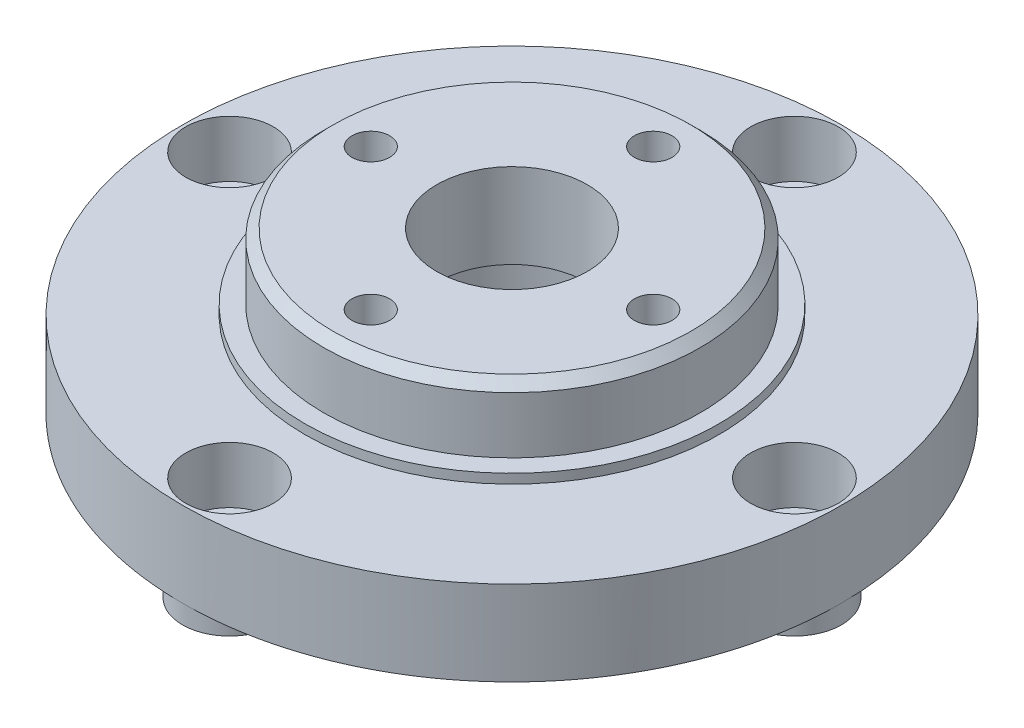
ISO-10303-21;
HEADER;
FILE_DESCRIPTION(('STEP AP214'),'2;1');
FILE_NAME('part.step','',(''),(''),'','','');
FILE_SCHEMA(('AUTOMOTIVE_DESIGN { 1 0 10303 214 1 1 1 1 }'));
ENDSEC;
DATA;
#1=APPLICATION_CONTEXT('core data for automotive mechanical design processes');
#2=APPLICATION_PROTOCOL_DEFINITION('international standard','automotive_design',2000,#1);
#3=PRODUCT_CONTEXT('',#1,'mechanical');
#4=PRODUCT('Part','Part','',(#3));
#5=PRODUCT_RELATED_PRODUCT_CATEGORY('part','',(#4));
#6=PRODUCT_DEFINITION_FORMATION('','',#4);
#7=PRODUCT_DEFINITION_CONTEXT('part definition',#1,'design');
#8=PRODUCT_DEFINITION('design','',#6,#7);
#9=PRODUCT_DEFINITION_SHAPE('','',#8);
#10=(LENGTH_UNIT() NAMED_UNIT(*) SI_UNIT(.MILLI.,.METRE.));
#11=(NAMED_UNIT(*) PLANE_ANGLE_UNIT() SI_UNIT($,.RADIAN.));
#12=(NAMED_UNIT(*) SI_UNIT($,.STERADIAN.) SOLID_ANGLE_UNIT());
#13=UNCERTAINTY_MEASURE_WITH_UNIT(LENGTH_MEASURE(1.E-05),#10,'distance_accuracy_value','');
#14=(GEOMETRIC_REPRESENTATION_CONTEXT(3) GLOBAL_UNCERTAINTY_ASSIGNED_CONTEXT((#13)) GLOBAL_UNIT_ASSIGNED_CONTEXT((#10,
#11,#12)) REPRESENTATION_CONTEXT('',''));
#15=CARTESIAN_POINT('',(0.,0.,0.));
#16=DIRECTION('',(0.,0.,1.));
#17=DIRECTION('',(1.,0.,0.));
#18=AXIS2_PLACEMENT_3D('',#15,#16,#17);
#19=CARTESIAN_POINT('',(0.,0.,0.));
#20=DIRECTION('',(0.,1.,0.));
#21=DIRECTION('',(0.,0.,1.));
#22=AXIS2_PLACEMENT_3D('',#19,#20,#21);
#23=PLANE('',#22);
#24=CARTESIAN_POINT('',(0.,0.,0.));
#25=DIRECTION('',(0.,1.,0.));
#26=DIRECTION('',(0.,0.,1.));
#27=AXIS2_PLACEMENT_3D('',#24,#25,#26);
#28=CIRCLE('',#27,12.1);
#29=CARTESIAN_POINT('',(0.,0.,12.1));
#30=VERTEX_POINT('',#29);
#31=EDGE_CURVE('E89',#30,#30,#28,.T.);
#32=ORIENTED_EDGE('',*,*,#31,.T.);
#33=EDGE_LOOP('',(#32));
#34=FACE_BOUND('',#33,.T.);
#35=CARTESIAN_POINT('',(0.,0.,-15.));
#36=DIRECTION('',(0.,1.,0.));
#37=DIRECTION('',(0.,0.,1.));
#38=AXIS2_PLACEMENT_3D('',#35,#36,#37);
#39=CIRCLE('',#38,2.);
#40=CARTESIAN_POINT('',(0.,0.,-13.));
#41=VERTEX_POINT('',#40);
#42=EDGE_CURVE('E580',#41,#41,#39,.T.);
#43=ORIENTED_EDGE('',*,*,#42,.T.);
#44=EDGE_LOOP('',(#43));
#45=FACE_BOUND('',#44,.T.);
#46=CARTESIAN_POINT('',(15.0000000000004,0.,-4.23570186157979E-13));
#47=DIRECTION('',(0.,1.,0.));
#48=DIRECTION('',(0.,0.,1.));
#49=AXIS2_PLACEMENT_3D('',#46,#47,#48);
#50=CIRCLE('',#49,2.00000000000033);
#51=CARTESIAN_POINT('',(15.0000000000004,0.,1.99999999999991));
#52=VERTEX_POINT('',#51);
#53=EDGE_CURVE('E584',#52,#52,#50,.T.);
#54=ORIENTED_EDGE('',*,*,#53,.T.);
#55=EDGE_LOOP('',(#54));
#56=FACE_BOUND('',#55,.T.);
#57=CARTESIAN_POINT('',(8.47140372315957E-13,0.,15.));
#58=DIRECTION('',(0.,1.,0.));
#59=DIRECTION('',(0.,0.,1.));
#60=AXIS2_PLACEMENT_3D('',#57,#58,#59);
#61=CIRCLE('',#60,2.00000000000091);
#62=CARTESIAN_POINT('',(8.47140372315957E-13,0.,17.0000000000009));
#63=VERTEX_POINT('',#62);
#64=EDGE_CURVE('E587',#63,#63,#61,.T.);
#65=ORIENTED_EDGE('',*,*,#64,.T.);
#66=EDGE_LOOP('',(#65));
#67=FACE_BOUND('',#66,.T.);
#68=CARTESIAN_POINT('',(-14.9999999999996,0.,4.254071563567E-13));
#69=DIRECTION('',(0.,1.,0.));
#70=DIRECTION('',(0.,0.,1.));
#71=AXIS2_PLACEMENT_3D('',#68,#69,#70);
#72=CIRCLE('',#71,2.00000000000068);
#73=CARTESIAN_POINT('',(-14.9999999999996,0.,2.00000000000111));
#74=VERTEX_POINT('',#73);
#75=EDGE_CURVE('E590',#74,#74,#72,.T.);
#76=ORIENTED_EDGE('',*,*,#75,.T.);
#77=EDGE_LOOP('',(#76));
#78=FACE_BOUND('',#77,.T.);
#79=CARTESIAN_POINT('',(0.,0.,0.));
#80=DIRECTION('',(0.,1.,0.));
#81=DIRECTION('',(0.,0.,1.));
#82=AXIS2_PLACEMENT_3D('',#79,#80,#81);
#83=CIRCLE('',#82,35.);
#84=CARTESIAN_POINT('',(0.,0.,-35.));
#85=VERTEX_POINT('',#84);
#86=CARTESIAN_POINT('',(-35.,0.,0.));
#87=VERTEX_POINT('',#86);
#88=EDGE_CURVE('E61',#85,#87,#83,.T.);
#89=ORIENTED_EDGE('',*,*,#88,.F.);
#90=CARTESIAN_POINT('',(0.,0.,-30.));
#91=DIRECTION('',(0.,-1.,0.));
#92=DIRECTION('',(0.,0.,-1.));
#93=AXIS2_PLACEMENT_3D('',#90,#91,#92);
#94=CIRCLE('',#93,5.00000000000001);
#95=EDGE_CURVE('E81',#85,#85,#94,.T.);
#96=ORIENTED_EDGE('',*,*,#95,.F.);
#97=CARTESIAN_POINT('',(35.,0.,0.));
#98=VERTEX_POINT('',#97);
#99=EDGE_CURVE('E71',#98,#85,#83,.T.);
#100=ORIENTED_EDGE('',*,*,#99,.F.);
#101=CARTESIAN_POINT('',(30.,0.,0.));
#102=DIRECTION('',(0.,-1.,0.));
#103=DIRECTION('',(0.,0.,-1.));
#104=AXIS2_PLACEMENT_3D('',#101,#102,#103);
#105=CIRCLE('',#104,5.);
#106=EDGE_CURVE('E568',#98,#98,#105,.T.);
#107=ORIENTED_EDGE('',*,*,#106,.F.);
#108=CARTESIAN_POINT('',(0.,0.,35.));
#109=VERTEX_POINT('',#108);
#110=EDGE_CURVE('E74',#109,#98,#83,.T.);
#111=ORIENTED_EDGE('',*,*,#110,.F.);
#112=CARTESIAN_POINT('',(0.,0.,30.));
#113=DIRECTION('',(0.,-1.,0.));
#114=DIRECTION('',(0.,0.,-1.));
#115=AXIS2_PLACEMENT_3D('',#112,#113,#114);
#116=CIRCLE('',#115,5.00000000000001);
#117=EDGE_CURVE('E559',#109,#109,#116,.T.);
#118=ORIENTED_EDGE('',*,*,#117,.F.);
#119=EDGE_CURVE('E65',#87,#109,#83,.T.);
#120=ORIENTED_EDGE('',*,*,#119,.F.);
#121=CARTESIAN_POINT('',(-30.,0.,0.));
#122=DIRECTION('',(0.,-1.,0.));
#123=DIRECTION('',(0.,0.,-1.));
#124=AXIS2_PLACEMENT_3D('',#121,#122,#123);
#125=CIRCLE('',#124,5.00000000000001);
#126=EDGE_CURVE('E83',#87,#87,#125,.T.);
#127=ORIENTED_EDGE('',*,*,#126,.F.);
#128=EDGE_LOOP('',(#89,#96,#100,#107,#111,#118,#120,#127));
#129=FACE_BOUND('',#128,.T.);
#130=ADVANCED_FACE('F45',(#34,#45,#56,#67,#78,#129),#23,.F.);
#131=CARTESIAN_POINT('',(0.,9.,0.));
#132=DIRECTION('',(0.,1.,0.));
#133=DIRECTION('',(0.,0.,1.));
#134=AXIS2_PLACEMENT_3D('',#131,#132,#133);
#135=PLANE('',#134);
#136=CARTESIAN_POINT('',(0.,9.,0.));
#137=DIRECTION('',(0.,1.,0.));
#138=DIRECTION('',(0.,0.,1.));
#139=AXIS2_PLACEMENT_3D('',#136,#137,#138);
#140=CIRCLE('',#139,35.);
#141=CARTESIAN_POINT('',(0.,9.,35.));
#142=VERTEX_POINT('',#141);
#143=EDGE_CURVE('E178',#142,#142,#140,.T.);
#144=ORIENTED_EDGE('',*,*,#143,.T.);
#145=EDGE_LOOP('',(#144));
#146=FACE_BOUND('',#145,.T.);
#147=CARTESIAN_POINT('',(-30.,9.,0.));
#148=DIRECTION('',(0.,1.,0.));
#149=DIRECTION('',(0.,0.,1.));
#150=AXIS2_PLACEMENT_3D('',#147,#148,#149);
#151=CIRCLE('',#150,4.65);
#152=CARTESIAN_POINT('',(-30.,9.,4.65000000000001));
#153=VERTEX_POINT('',#152);
#154=EDGE_CURVE('E523',#153,#153,#151,.T.);
#155=ORIENTED_EDGE('',*,*,#154,.F.);
#156=EDGE_LOOP('',(#155));
#157=FACE_BOUND('',#156,.T.);
#158=CARTESIAN_POINT('',(0.,9.,-30.));
#159=DIRECTION('',(0.,1.,0.));
#160=DIRECTION('',(0.,0.,1.));
#161=AXIS2_PLACEMENT_3D('',#158,#159,#160);
#162=CIRCLE('',#161,4.65);
#163=CARTESIAN_POINT('',(0.,9.,-25.35));
#164=VERTEX_POINT('',#163);
#165=EDGE_CURVE('E526',#164,#164,#162,.T.);
#166=ORIENTED_EDGE('',*,*,#165,.F.);
#167=EDGE_LOOP('',(#166));
#168=FACE_BOUND('',#167,.T.);
#169=CARTESIAN_POINT('',(30.,9.,0.));
#170=DIRECTION('',(0.,1.,0.));
#171=DIRECTION('',(0.,0.,1.));
#172=AXIS2_PLACEMENT_3D('',#169,#170,#171);
#173=CIRCLE('',#172,4.65);
#174=CARTESIAN_POINT('',(30.,9.,4.65));
#175=VERTEX_POINT('',#174);
#176=EDGE_CURVE('E529',#175,#175,#173,.T.);
#177=ORIENTED_EDGE('',*,*,#176,.F.);
#178=EDGE_LOOP('',(#177));
#179=FACE_BOUND('',#178,.T.);
#180=CARTESIAN_POINT('',(0.,9.,30.));
#181=DIRECTION('',(0.,1.,0.));
#182=DIRECTION('',(0.,0.,1.));
#183=AXIS2_PLACEMENT_3D('',#180,#181,#182);
#184=CIRCLE('',#183,4.65);
#185=CARTESIAN_POINT('',(0.,9.,34.65));
#186=VERTEX_POINT('',#185);
#187=EDGE_CURVE('E186',#186,#186,#184,.T.);
#188=ORIENTED_EDGE('',*,*,#187,.F.);
#189=EDGE_LOOP('',(#188));
#190=FACE_BOUND('',#189,.T.);
#191=CARTESIAN_POINT('',(0.,9.,0.));
#192=DIRECTION('',(0.,1.,0.));
#193=DIRECTION('',(0.,0.,1.));
#194=AXIS2_PLACEMENT_3D('',#191,#192,#193);
#195=CIRCLE('',#194,22.);
#196=CARTESIAN_POINT('',(0.,9.,22.));
#197=VERTEX_POINT('',#196);
#198=EDGE_CURVE('E541',#197,#197,#195,.T.);
#199=ORIENTED_EDGE('',*,*,#198,.F.);
#200=EDGE_LOOP('',(#199));
#201=FACE_BOUND('',#200,.T.);
#202=ADVANCED_FACE('F112',(#146,#157,#168,#179,#190,#201),#135,.T.);
#203=CARTESIAN_POINT('',(0.,3.,0.));
#204=DIRECTION('',(0.,-1.,0.));
#205=DIRECTION('',(0.,0.,-1.));
#206=AXIS2_PLACEMENT_3D('',#203,#204,#205);
#207=CYLINDRICAL_SURFACE('',#206,11.1);
#208=CARTESIAN_POINT('',(0.,1.00000000000002,0.));
#209=DIRECTION('',(0.,1.,0.));
#210=DIRECTION('',(0.,0.,1.));
#211=AXIS2_PLACEMENT_3D('',#208,#209,#210);
#212=CIRCLE('',#211,11.1);
#213=CARTESIAN_POINT('',(0.,1.00000000000002,11.1));
#214=VERTEX_POINT('',#213);
#215=EDGE_CURVE('E91',#214,#214,#212,.F.);
#216=ORIENTED_EDGE('',*,*,#215,.T.);
#217=EDGE_LOOP('',(#216));
#218=FACE_BOUND('',#217,.T.);
#219=CARTESIAN_POINT('',(0.,8.,0.));
#220=DIRECTION('',(0.,1.,0.));
#221=DIRECTION('',(0.,0.,1.));
#222=AXIS2_PLACEMENT_3D('',#219,#220,#221);
#223=CIRCLE('',#222,11.1);
#224=CARTESIAN_POINT('',(0.,8.,11.1));
#225=VERTEX_POINT('',#224);
#226=EDGE_CURVE('E169',#225,#225,#223,.T.);
#227=ORIENTED_EDGE('',*,*,#226,.T.);
#228=EDGE_LOOP('',(#227));
#229=FACE_BOUND('',#228,.T.);
#230=ADVANCED_FACE('F119',(#218,#229),#207,.F.);
#231=CARTESIAN_POINT('',(0.,3.,0.));
#232=DIRECTION('',(0.,1.,0.));
#233=DIRECTION('',(0.,0.,1.));
#234=AXIS2_PLACEMENT_3D('',#231,#232,#233);
#235=PLANE('',#234);
#236=CARTESIAN_POINT('',(0.,3.,30.));
#237=DIRECTION('',(0.,1.,0.));
#238=DIRECTION('',(0.,0.,1.));
#239=AXIS2_PLACEMENT_3D('',#236,#237,#238);
#240=CIRCLE('',#239,2.65);
#241=CARTESIAN_POINT('',(0.,3.,32.65));
#242=VERTEX_POINT('',#241);
#243=EDGE_CURVE('E163',#242,#242,#240,.T.);
#244=ORIENTED_EDGE('',*,*,#243,.F.);
#245=EDGE_LOOP('',(#244));
#246=FACE_BOUND('',#245,.T.);
#247=CARTESIAN_POINT('',(0.,3.,30.));
#248=DIRECTION('',(0.,1.,0.));
#249=DIRECTION('',(0.,0.,1.));
#250=AXIS2_PLACEMENT_3D('',#247,#248,#249);
#251=CIRCLE('',#250,4.65);
#252=CARTESIAN_POINT('',(0.,3.,34.65));
#253=VERTEX_POINT('',#252);
#254=EDGE_CURVE('E166',#253,#253,#251,.T.);
#255=ORIENTED_EDGE('',*,*,#254,.T.);
#256=EDGE_LOOP('',(#255));
#257=FACE_BOUND('',#256,.T.);
#258=ADVANCED_FACE('F125',(#246,#257),#235,.T.);
#259=CARTESIAN_POINT('',(30.,3.,0.));
#260=DIRECTION('',(0.,1.,0.));
#261=DIRECTION('',(0.,0.,1.));
#262=AXIS2_PLACEMENT_3D('',#259,#260,#261);
#263=CIRCLE('',#262,2.65);
#264=CARTESIAN_POINT('',(30.,3.,2.65));
#265=VERTEX_POINT('',#264);
#266=EDGE_CURVE('E86',#265,#265,#263,.T.);
#267=ORIENTED_EDGE('',*,*,#266,.F.);
#268=EDGE_LOOP('',(#267));
#269=FACE_BOUND('',#268,.T.);
#270=CARTESIAN_POINT('',(30.,3.,0.));
#271=DIRECTION('',(0.,1.,0.));
#272=DIRECTION('',(0.,0.,1.));
#273=AXIS2_PLACEMENT_3D('',#270,#271,#272);
#274=CIRCLE('',#273,4.65);
#275=CARTESIAN_POINT('',(30.,3.,4.65));
#276=VERTEX_POINT('',#275);
#277=EDGE_CURVE('E168',#276,#276,#274,.T.);
#278=ORIENTED_EDGE('',*,*,#277,.T.);
#279=EDGE_LOOP('',(#278));
#280=FACE_BOUND('',#279,.T.);
#281=ADVANCED_FACE('F149',(#269,#280),#235,.T.);
#282=CARTESIAN_POINT('',(0.,3.,-30.));
#283=DIRECTION('',(0.,1.,0.));
#284=DIRECTION('',(0.,0.,1.));
#285=AXIS2_PLACEMENT_3D('',#282,#283,#284);
#286=CIRCLE('',#285,2.65);
#287=CARTESIAN_POINT('',(0.,3.,-27.35));
#288=VERTEX_POINT('',#287);
#289=EDGE_CURVE('E84',#288,#288,#286,.T.);
#290=ORIENTED_EDGE('',*,*,#289,.F.);
#291=EDGE_LOOP('',(#290));
#292=FACE_BOUND('',#291,.T.);
#293=CARTESIAN_POINT('',(0.,3.,-30.));
#294=DIRECTION('',(0.,1.,0.));
#295=DIRECTION('',(0.,0.,1.));
#296=AXIS2_PLACEMENT_3D('',#293,#294,#295);
#297=CIRCLE('',#296,4.65);
#298=CARTESIAN_POINT('',(0.,3.,-25.35));
#299=VERTEX_POINT('',#298);
#300=EDGE_CURVE('E172',#299,#299,#297,.T.);
#301=ORIENTED_EDGE('',*,*,#300,.T.);
#302=EDGE_LOOP('',(#301));
#303=FACE_BOUND('',#302,.T.);
#304=ADVANCED_FACE('F143',(#292,#303),#235,.T.);
#305=CARTESIAN_POINT('',(-30.,3.,0.));
#306=DIRECTION('',(0.,1.,0.));
#307=DIRECTION('',(0.,0.,1.));
#308=AXIS2_PLACEMENT_3D('',#305,#306,#307);
#309=CIRCLE('',#308,2.65);
#310=CARTESIAN_POINT('',(-30.,3.,2.65000000000001));
#311=VERTEX_POINT('',#310);
#312=EDGE_CURVE('E187',#311,#311,#309,.T.);
#313=ORIENTED_EDGE('',*,*,#312,.F.);
#314=EDGE_LOOP('',(#313));
#315=FACE_BOUND('',#314,.T.);
#316=CARTESIAN_POINT('',(-30.,3.,0.));
#317=DIRECTION('',(0.,1.,0.));
#318=DIRECTION('',(0.,0.,1.));
#319=AXIS2_PLACEMENT_3D('',#316,#317,#318);
#320=CIRCLE('',#319,4.65);
#321=CARTESIAN_POINT('',(-30.,3.,4.65000000000001));
#322=VERTEX_POINT('',#321);
#323=EDGE_CURVE('E183',#322,#322,#320,.T.);
#324=ORIENTED_EDGE('',*,*,#323,.T.);
#325=EDGE_LOOP('',(#324));
#326=FACE_BOUND('',#325,.T.);
#327=ADVANCED_FACE('F129',(#315,#326),#235,.T.);
#328=CARTESIAN_POINT('',(0.,3.,0.));
#329=DIRECTION('',(0.,-1.,0.));
#330=DIRECTION('',(0.,0.,-1.));
#331=AXIS2_PLACEMENT_3D('',#328,#329,#330);
#332=CYLINDRICAL_SURFACE('',#331,35.);
#333=ORIENTED_EDGE('',*,*,#119,.T.);
#334=ORIENTED_EDGE('',*,*,#110,.T.);
#335=ORIENTED_EDGE('',*,*,#99,.T.);
#336=ORIENTED_EDGE('',*,*,#88,.T.);
#337=EDGE_LOOP('',(#333,#334,#335,#336));
#338=FACE_BOUND('',#337,.T.);
#339=ORIENTED_EDGE('',*,*,#143,.F.);
#340=EDGE_LOOP('',(#339));
#341=FACE_BOUND('',#340,.T.);
#342=ADVANCED_FACE('F72',(#338,#341),#332,.T.);
#343=CARTESIAN_POINT('',(0.,3.,-30.));
#344=DIRECTION('',(0.,-1.,0.));
#345=DIRECTION('',(0.,0.,-1.));
#346=AXIS2_PLACEMENT_3D('',#343,#344,#345);
#347=CYLINDRICAL_SURFACE('',#346,2.65);
#348=ORIENTED_EDGE('',*,*,#289,.T.);
#349=EDGE_LOOP('',(#348));
#350=FACE_BOUND('',#349,.T.);
#351=CARTESIAN_POINT('',(0.,-2.,-30.));
#352=DIRECTION('',(0.,-1.,0.));
#353=DIRECTION('',(0.,0.,-1.));
#354=AXIS2_PLACEMENT_3D('',#351,#352,#353);
#355=CIRCLE('',#354,2.65);
#356=CARTESIAN_POINT('',(0.,-2.,-32.65));
#357=VERTEX_POINT('',#356);
#358=EDGE_CURVE('E572',#357,#357,#355,.T.);
#359=ORIENTED_EDGE('',*,*,#358,.T.);
#360=EDGE_LOOP('',(#359));
#361=FACE_BOUND('',#360,.T.);
#362=ADVANCED_FACE('F128',(#350,#361),#347,.F.);
#363=CARTESIAN_POINT('',(30.,3.,0.));
#364=DIRECTION('',(0.,-1.,0.));
#365=DIRECTION('',(0.,0.,-1.));
#366=AXIS2_PLACEMENT_3D('',#363,#364,#365);
#367=CYLINDRICAL_SURFACE('',#366,2.65);
#368=ORIENTED_EDGE('',*,*,#266,.T.);
#369=EDGE_LOOP('',(#368));
#370=FACE_BOUND('',#369,.T.);
#371=CARTESIAN_POINT('',(30.,-2.,0.));
#372=DIRECTION('',(0.,-1.,0.));
#373=DIRECTION('',(0.,0.,-1.));
#374=AXIS2_PLACEMENT_3D('',#371,#372,#373);
#375=CIRCLE('',#374,2.65);
#376=CARTESIAN_POINT('',(30.,-2.,-2.65));
#377=VERTEX_POINT('',#376);
#378=EDGE_CURVE('E563',#377,#377,#375,.T.);
#379=ORIENTED_EDGE('',*,*,#378,.T.);
#380=EDGE_LOOP('',(#379));
#381=FACE_BOUND('',#380,.T.);
#382=ADVANCED_FACE('F139',(#370,#381),#367,.F.);
#383=CARTESIAN_POINT('',(0.,3.,30.));
#384=DIRECTION('',(0.,-1.,0.));
#385=DIRECTION('',(0.,0.,-1.));
#386=AXIS2_PLACEMENT_3D('',#383,#384,#385);
#387=CYLINDRICAL_SURFACE('',#386,2.65);
#388=ORIENTED_EDGE('',*,*,#243,.T.);
#389=EDGE_LOOP('',(#388));
#390=FACE_BOUND('',#389,.T.);
#391=CARTESIAN_POINT('',(0.,-2.,30.));
#392=DIRECTION('',(0.,-1.,0.));
#393=DIRECTION('',(0.,0.,-1.));
#394=AXIS2_PLACEMENT_3D('',#391,#392,#393);
#395=CIRCLE('',#394,2.65);
#396=CARTESIAN_POINT('',(0.,-2.,27.35));
#397=VERTEX_POINT('',#396);
#398=EDGE_CURVE('E556',#397,#397,#395,.T.);
#399=ORIENTED_EDGE('',*,*,#398,.T.);
#400=EDGE_LOOP('',(#399));
#401=FACE_BOUND('',#400,.T.);
#402=ADVANCED_FACE('F220',(#390,#401),#387,.F.);
#403=CARTESIAN_POINT('',(-30.,3.,0.));
#404=DIRECTION('',(0.,-1.,0.));
#405=DIRECTION('',(0.,0.,-1.));
#406=AXIS2_PLACEMENT_3D('',#403,#404,#405);
#407=CYLINDRICAL_SURFACE('',#406,2.65);
#408=ORIENTED_EDGE('',*,*,#312,.T.);
#409=EDGE_LOOP('',(#408));
#410=FACE_BOUND('',#409,.T.);
#411=CARTESIAN_POINT('',(-30.,-2.,0.));
#412=DIRECTION('',(0.,-1.,0.));
#413=DIRECTION('',(0.,0.,-1.));
#414=AXIS2_PLACEMENT_3D('',#411,#412,#413);
#415=CIRCLE('',#414,2.65);
#416=CARTESIAN_POINT('',(-30.,-2.,-2.65));
#417=VERTEX_POINT('',#416);
#418=EDGE_CURVE('E551',#417,#417,#415,.T.);
#419=ORIENTED_EDGE('',*,*,#418,.T.);
#420=EDGE_LOOP('',(#419));
#421=FACE_BOUND('',#420,.T.);
#422=ADVANCED_FACE('F217',(#410,#421),#407,.F.);
#423=CARTESIAN_POINT('',(-30.,9.,0.));
#424=DIRECTION('',(0.,-1.,0.));
#425=DIRECTION('',(0.,0.,-1.));
#426=AXIS2_PLACEMENT_3D('',#423,#424,#425);
#427=CYLINDRICAL_SURFACE('',#426,4.65);
#428=ORIENTED_EDGE('',*,*,#154,.T.);
#429=EDGE_LOOP('',(#428));
#430=FACE_BOUND('',#429,.T.);
#431=ORIENTED_EDGE('',*,*,#323,.F.);
#432=EDGE_LOOP('',(#431));
#433=FACE_BOUND('',#432,.T.);
#434=ADVANCED_FACE('F211',(#430,#433),#427,.F.);
#435=CARTESIAN_POINT('',(0.,9.,-30.));
#436=DIRECTION('',(0.,-1.,0.));
#437=DIRECTION('',(0.,0.,-1.));
#438=AXIS2_PLACEMENT_3D('',#435,#436,#437);
#439=CYLINDRICAL_SURFACE('',#438,4.65);
#440=ORIENTED_EDGE('',*,*,#165,.T.);
#441=EDGE_LOOP('',(#440));
#442=FACE_BOUND('',#441,.T.);
#443=ORIENTED_EDGE('',*,*,#300,.F.);
#444=EDGE_LOOP('',(#443));
#445=FACE_BOUND('',#444,.T.);
#446=ADVANCED_FACE('F201',(#442,#445),#439,.F.);
#447=CARTESIAN_POINT('',(30.,9.,0.));
#448=DIRECTION('',(0.,-1.,0.));
#449=DIRECTION('',(0.,0.,-1.));
#450=AXIS2_PLACEMENT_3D('',#447,#448,#449);
#451=CYLINDRICAL_SURFACE('',#450,4.65);
#452=ORIENTED_EDGE('',*,*,#176,.T.);
#453=EDGE_LOOP('',(#452));
#454=FACE_BOUND('',#453,.T.);
#455=ORIENTED_EDGE('',*,*,#277,.F.);
#456=EDGE_LOOP('',(#455));
#457=FACE_BOUND('',#456,.T.);
#458=ADVANCED_FACE('F198',(#454,#457),#451,.F.);
#459=CARTESIAN_POINT('',(0.,9.,30.));
#460=DIRECTION('',(0.,-1.,0.));
#461=DIRECTION('',(0.,0.,-1.));
#462=AXIS2_PLACEMENT_3D('',#459,#460,#461);
#463=CYLINDRICAL_SURFACE('',#462,4.65);
#464=ORIENTED_EDGE('',*,*,#187,.T.);
#465=EDGE_LOOP('',(#464));
#466=FACE_BOUND('',#465,.T.);
#467=ORIENTED_EDGE('',*,*,#254,.F.);
#468=EDGE_LOOP('',(#467));
#469=FACE_BOUND('',#468,.T.);
#470=ADVANCED_FACE('F200',(#466,#469),#463,.F.);
#471=CARTESIAN_POINT('',(0.,8.,0.));
#472=DIRECTION('',(0.,1.,0.));
#473=DIRECTION('',(0.,0.,1.));
#474=AXIS2_PLACEMENT_3D('',#471,#472,#473);
#475=PLANE('',#474);
#476=CARTESIAN_POINT('',(0.,8.,0.));
#477=DIRECTION('',(0.,1.,0.));
#478=DIRECTION('',(0.,0.,1.));
#479=AXIS2_PLACEMENT_3D('',#476,#477,#478);
#480=CIRCLE('',#479,8.);
#481=CARTESIAN_POINT('',(0.,8.,8.));
#482=VERTEX_POINT('',#481);
#483=EDGE_CURVE('E175',#482,#482,#480,.T.);
#484=ORIENTED_EDGE('',*,*,#483,.T.);
#485=EDGE_LOOP('',(#484));
#486=FACE_BOUND('',#485,.T.);
#487=ORIENTED_EDGE('',*,*,#226,.F.);
#488=EDGE_LOOP('',(#487));
#489=FACE_BOUND('',#488,.T.);
#490=ADVANCED_FACE('F208',(#486,#489),#475,.F.);
#491=CARTESIAN_POINT('',(0.,8.,0.));
#492=DIRECTION('',(0.,1.,0.));
#493=DIRECTION('',(0.,0.,1.));
#494=AXIS2_PLACEMENT_3D('',#491,#492,#493);
#495=CYLINDRICAL_SURFACE('',#494,8.);
#496=ORIENTED_EDGE('',*,*,#483,.F.);
#497=EDGE_LOOP('',(#496));
#498=FACE_BOUND('',#497,.T.);
#499=CARTESIAN_POINT('',(0.,17.,0.));
#500=DIRECTION('',(0.,1.,0.));
#501=DIRECTION('',(0.,0.,1.));
#502=AXIS2_PLACEMENT_3D('',#499,#500,#501);
#503=CIRCLE('',#502,8.);
#504=CARTESIAN_POINT('',(0.,17.,8.));
#505=VERTEX_POINT('',#504);
#506=EDGE_CURVE('E537',#505,#505,#503,.T.);
#507=ORIENTED_EDGE('',*,*,#506,.T.);
#508=EDGE_LOOP('',(#507));
#509=FACE_BOUND('',#508,.T.);
#510=ADVANCED_FACE('F375',(#498,#509),#495,.F.);
#511=CARTESIAN_POINT('',(0.,17.,0.));
#512=DIRECTION('',(0.,1.,0.));
#513=DIRECTION('',(0.,0.,1.));
#514=AXIS2_PLACEMENT_3D('',#511,#512,#513);
#515=PLANE('',#514);
#516=CARTESIAN_POINT('',(0.,17.,0.));
#517=DIRECTION('',(0.,1.,0.));
#518=DIRECTION('',(0.,0.,1.));
#519=AXIS2_PLACEMENT_3D('',#516,#517,#518);
#520=CIRCLE('',#519,19.);
#521=CARTESIAN_POINT('',(0.,17.,19.));
#522=VERTEX_POINT('',#521);
#523=EDGE_CURVE('E54',#522,#522,#520,.T.);
#524=ORIENTED_EDGE('',*,*,#523,.T.);
#525=EDGE_LOOP('',(#524));
#526=FACE_BOUND('',#525,.T.);
#527=CARTESIAN_POINT('',(0.,17.,-15.));
#528=DIRECTION('',(0.,1.,0.));
#529=DIRECTION('',(0.,0.,1.));
#530=AXIS2_PLACEMENT_3D('',#527,#528,#529);
#531=CIRCLE('',#530,2.);
#532=CARTESIAN_POINT('',(0.,17.,-13.));
#533=VERTEX_POINT('',#532);
#534=EDGE_CURVE('E593',#533,#533,#531,.T.);
#535=ORIENTED_EDGE('',*,*,#534,.F.);
#536=EDGE_LOOP('',(#535));
#537=FACE_BOUND('',#536,.T.);
#538=CARTESIAN_POINT('',(15.0000000000004,17.,-4.23570186157979E-13));
#539=DIRECTION('',(0.,1.,0.));
#540=DIRECTION('',(0.,0.,1.));
#541=AXIS2_PLACEMENT_3D('',#538,#539,#540);
#542=CIRCLE('',#541,2.00000000000033);
#543=CARTESIAN_POINT('',(15.0000000000004,17.,1.99999999999991));
#544=VERTEX_POINT('',#543);
#545=EDGE_CURVE('E600',#544,#544,#542,.T.);
#546=ORIENTED_EDGE('',*,*,#545,.F.);
#547=EDGE_LOOP('',(#546));
#548=FACE_BOUND('',#547,.T.);
#549=CARTESIAN_POINT('',(8.47140372315957E-13,17.,15.));
#550=DIRECTION('',(0.,1.,0.));
#551=DIRECTION('',(0.,0.,1.));
#552=AXIS2_PLACEMENT_3D('',#549,#550,#551);
#553=CIRCLE('',#552,2.00000000000091);
#554=CARTESIAN_POINT('',(8.47140372315957E-13,17.,17.0000000000009));
#555=VERTEX_POINT('',#554);
#556=EDGE_CURVE('E597',#555,#555,#553,.T.);
#557=ORIENTED_EDGE('',*,*,#556,.F.);
#558=EDGE_LOOP('',(#557));
#559=FACE_BOUND('',#558,.T.);
#560=CARTESIAN_POINT('',(-14.9999999999996,17.,4.254071563567E-13));
#561=DIRECTION('',(0.,1.,0.));
#562=DIRECTION('',(0.,0.,1.));
#563=AXIS2_PLACEMENT_3D('',#560,#561,#562);
#564=CIRCLE('',#563,2.00000000000068);
#565=CARTESIAN_POINT('',(-14.9999999999996,17.,2.00000000000111));
#566=VERTEX_POINT('',#565);
#567=EDGE_CURVE('E594',#566,#566,#564,.T.);
#568=ORIENTED_EDGE('',*,*,#567,.F.);
#569=EDGE_LOOP('',(#568));
#570=FACE_BOUND('',#569,.T.);
#571=ORIENTED_EDGE('',*,*,#506,.F.);
#572=EDGE_LOOP('',(#571));
#573=FACE_BOUND('',#572,.T.);
#574=ADVANCED_FACE('F99',(#526,#537,#548,#559,#570,#573),#515,.T.);
#575=CARTESIAN_POINT('',(0.,17.,0.));
#576=DIRECTION('',(0.,-1.,0.));
#577=DIRECTION('',(0.,0.,-1.));
#578=AXIS2_PLACEMENT_3D('',#575,#576,#577);
#579=CYLINDRICAL_SURFACE('',#578,20.);
#580=CARTESIAN_POINT('',(0.,16.,0.));
#581=DIRECTION('',(0.,1.,0.));
#582=DIRECTION('',(0.,0.,1.));
#583=AXIS2_PLACEMENT_3D('',#580,#581,#582);
#584=CIRCLE('',#583,20.);
#585=CARTESIAN_POINT('',(0.,16.,20.));
#586=VERTEX_POINT('',#585);
#587=EDGE_CURVE('E11',#586,#586,#584,.F.);
#588=ORIENTED_EDGE('',*,*,#587,.T.);
#589=EDGE_LOOP('',(#588));
#590=FACE_BOUND('',#589,.T.);
#591=CARTESIAN_POINT('',(0.,10.,0.));
#592=DIRECTION('',(0.,1.,0.));
#593=DIRECTION('',(0.,0.,1.));
#594=AXIS2_PLACEMENT_3D('',#591,#592,#593);
#595=CIRCLE('',#594,20.);
#596=CARTESIAN_POINT('',(0.,10.,20.));
#597=VERTEX_POINT('',#596);
#598=EDGE_CURVE('E544',#597,#597,#595,.T.);
#599=ORIENTED_EDGE('',*,*,#598,.T.);
#600=EDGE_LOOP('',(#599));
#601=FACE_BOUND('',#600,.T.);
#602=ADVANCED_FACE('F362',(#590,#601),#579,.T.);
#603=CARTESIAN_POINT('',(0.,10.,0.));
#604=DIRECTION('',(0.,1.,0.));
#605=DIRECTION('',(0.,0.,1.));
#606=AXIS2_PLACEMENT_3D('',#603,#604,#605);
#607=PLANE('',#606);
#608=CARTESIAN_POINT('',(0.,10.,0.));
#609=DIRECTION('',(0.,1.,0.));
#610=DIRECTION('',(0.,0.,1.));
#611=AXIS2_PLACEMENT_3D('',#608,#609,#610);
#612=CIRCLE('',#611,22.);
#613=CARTESIAN_POINT('',(0.,10.,22.));
#614=VERTEX_POINT('',#613);
#615=EDGE_CURVE('E540',#614,#614,#612,.T.);
#616=ORIENTED_EDGE('',*,*,#615,.T.);
#617=EDGE_LOOP('',(#616));
#618=FACE_BOUND('',#617,.T.);
#619=ORIENTED_EDGE('',*,*,#598,.F.);
#620=EDGE_LOOP('',(#619));
#621=FACE_BOUND('',#620,.T.);
#622=ADVANCED_FACE('F366',(#618,#621),#607,.T.);
#623=CARTESIAN_POINT('',(0.,10.,0.));
#624=DIRECTION('',(0.,-1.,0.));
#625=DIRECTION('',(0.,0.,-1.));
#626=AXIS2_PLACEMENT_3D('',#623,#624,#625);
#627=CYLINDRICAL_SURFACE('',#626,22.);
#628=ORIENTED_EDGE('',*,*,#615,.F.);
#629=EDGE_LOOP('',(#628));
#630=FACE_BOUND('',#629,.T.);
#631=ORIENTED_EDGE('',*,*,#198,.T.);
#632=EDGE_LOOP('',(#631));
#633=FACE_BOUND('',#632,.T.);
#634=ADVANCED_FACE('F249',(#630,#633),#627,.T.);
#635=CARTESIAN_POINT('',(-30.,-2.,0.));
#636=DIRECTION('',(0.,-1.,0.));
#637=DIRECTION('',(0.,0.,-1.));
#638=AXIS2_PLACEMENT_3D('',#635,#636,#637);
#639=PLANE('',#638);
#640=CARTESIAN_POINT('',(-30.,-2.,0.));
#641=DIRECTION('',(0.,-1.,0.));
#642=DIRECTION('',(0.,0.,-1.));
#643=AXIS2_PLACEMENT_3D('',#640,#641,#642);
#644=CIRCLE('',#643,5.00000000000001);
#645=CARTESIAN_POINT('',(-30.,-2.,-5.00000000000001));
#646=VERTEX_POINT('',#645);
#647=EDGE_CURVE('E549',#646,#646,#644,.T.);
#648=ORIENTED_EDGE('',*,*,#647,.T.);
#649=EDGE_LOOP('',(#648));
#650=FACE_BOUND('',#649,.T.);
#651=ORIENTED_EDGE('',*,*,#418,.F.);
#652=EDGE_LOOP('',(#651));
#653=FACE_BOUND('',#652,.T.);
#654=ADVANCED_FACE('F245',(#650,#653),#639,.T.);
#655=CARTESIAN_POINT('',(-30.,-2.,0.));
#656=DIRECTION('',(0.,1.,0.));
#657=DIRECTION('',(0.,0.,1.));
#658=AXIS2_PLACEMENT_3D('',#655,#656,#657);
#659=CYLINDRICAL_SURFACE('',#658,5.00000000000001);
#660=ORIENTED_EDGE('',*,*,#647,.F.);
#661=EDGE_LOOP('',(#660));
#662=FACE_BOUND('',#661,.T.);
#663=ORIENTED_EDGE('',*,*,#126,.T.);
#664=EDGE_LOOP('',(#663));
#665=FACE_BOUND('',#664,.T.);
#666=ADVANCED_FACE('F248',(#662,#665),#659,.T.);
#667=CARTESIAN_POINT('',(0.,-2.,30.));
#668=DIRECTION('',(0.,-1.,0.));
#669=DIRECTION('',(0.,0.,-1.));
#670=AXIS2_PLACEMENT_3D('',#667,#668,#669);
#671=PLANE('',#670);
#672=CARTESIAN_POINT('',(0.,-2.,30.));
#673=DIRECTION('',(0.,-1.,0.));
#674=DIRECTION('',(0.,0.,-1.));
#675=AXIS2_PLACEMENT_3D('',#672,#673,#674);
#676=CIRCLE('',#675,5.00000000000001);
#677=CARTESIAN_POINT('',(0.,-2.,25.));
#678=VERTEX_POINT('',#677);
#679=EDGE_CURVE('E560',#678,#678,#676,.T.);
#680=ORIENTED_EDGE('',*,*,#679,.T.);
#681=EDGE_LOOP('',(#680));
#682=FACE_BOUND('',#681,.T.);
#683=ORIENTED_EDGE('',*,*,#398,.F.);
#684=EDGE_LOOP('',(#683));
#685=FACE_BOUND('',#684,.T.);
#686=ADVANCED_FACE('F258',(#682,#685),#671,.T.);
#687=CARTESIAN_POINT('',(0.,-2.,30.));
#688=DIRECTION('',(0.,1.,0.));
#689=DIRECTION('',(0.,0.,1.));
#690=AXIS2_PLACEMENT_3D('',#687,#688,#689);
#691=CYLINDRICAL_SURFACE('',#690,5.00000000000001);
#692=ORIENTED_EDGE('',*,*,#679,.F.);
#693=EDGE_LOOP('',(#692));
#694=FACE_BOUND('',#693,.T.);
#695=ORIENTED_EDGE('',*,*,#117,.T.);
#696=EDGE_LOOP('',(#695));
#697=FACE_BOUND('',#696,.T.);
#698=ADVANCED_FACE('F267',(#694,#697),#691,.T.);
#699=CARTESIAN_POINT('',(30.,-2.,0.));
#700=DIRECTION('',(0.,-1.,0.));
#701=DIRECTION('',(0.,0.,-1.));
#702=AXIS2_PLACEMENT_3D('',#699,#700,#701);
#703=PLANE('',#702);
#704=CARTESIAN_POINT('',(30.,-2.,0.));
#705=DIRECTION('',(0.,-1.,0.));
#706=DIRECTION('',(0.,0.,-1.));
#707=AXIS2_PLACEMENT_3D('',#704,#705,#706);
#708=CIRCLE('',#707,5.);
#709=CARTESIAN_POINT('',(30.,-2.,-5.00000000000001));
#710=VERTEX_POINT('',#709);
#711=EDGE_CURVE('E569',#710,#710,#708,.T.);
#712=ORIENTED_EDGE('',*,*,#711,.T.);
#713=EDGE_LOOP('',(#712));
#714=FACE_BOUND('',#713,.T.);
#715=ORIENTED_EDGE('',*,*,#378,.F.);
#716=EDGE_LOOP('',(#715));
#717=FACE_BOUND('',#716,.T.);
#718=ADVANCED_FACE('F276',(#714,#717),#703,.T.);
#719=CARTESIAN_POINT('',(30.,-2.,0.));
#720=DIRECTION('',(0.,1.,0.));
#721=DIRECTION('',(0.,0.,1.));
#722=AXIS2_PLACEMENT_3D('',#719,#720,#721);
#723=CYLINDRICAL_SURFACE('',#722,5.);
#724=ORIENTED_EDGE('',*,*,#711,.F.);
#725=EDGE_LOOP('',(#724));
#726=FACE_BOUND('',#725,.T.);
#727=ORIENTED_EDGE('',*,*,#106,.T.);
#728=EDGE_LOOP('',(#727));
#729=FACE_BOUND('',#728,.T.);
#730=ADVANCED_FACE('F285',(#726,#729),#723,.T.);
#731=CARTESIAN_POINT('',(0.,-2.,-30.));
#732=DIRECTION('',(0.,-1.,0.));
#733=DIRECTION('',(0.,0.,-1.));
#734=AXIS2_PLACEMENT_3D('',#731,#732,#733);
#735=PLANE('',#734);
#736=CARTESIAN_POINT('',(0.,-2.,-30.));
#737=DIRECTION('',(0.,-1.,0.));
#738=DIRECTION('',(0.,0.,-1.));
#739=AXIS2_PLACEMENT_3D('',#736,#737,#738);
#740=CIRCLE('',#739,5.00000000000001);
#741=CARTESIAN_POINT('',(0.,-2.,-35.));
#742=VERTEX_POINT('',#741);
#743=EDGE_CURVE('E577',#742,#742,#740,.T.);
#744=ORIENTED_EDGE('',*,*,#743,.T.);
#745=EDGE_LOOP('',(#744));
#746=FACE_BOUND('',#745,.T.);
#747=ORIENTED_EDGE('',*,*,#358,.F.);
#748=EDGE_LOOP('',(#747));
#749=FACE_BOUND('',#748,.T.);
#750=ADVANCED_FACE('F294',(#746,#749),#735,.T.);
#751=CARTESIAN_POINT('',(0.,-2.,-30.));
#752=DIRECTION('',(0.,1.,0.));
#753=DIRECTION('',(0.,0.,1.));
#754=AXIS2_PLACEMENT_3D('',#751,#752,#753);
#755=CYLINDRICAL_SURFACE('',#754,5.00000000000001);
#756=ORIENTED_EDGE('',*,*,#743,.F.);
#757=EDGE_LOOP('',(#756));
#758=FACE_BOUND('',#757,.T.);
#759=ORIENTED_EDGE('',*,*,#95,.T.);
#760=EDGE_LOOP('',(#759));
#761=FACE_BOUND('',#760,.T.);
#762=ADVANCED_FACE('F303',(#758,#761),#755,.T.);
#763=CARTESIAN_POINT('',(-14.9999999999996,-2.,4.254071563567E-13));
#764=DIRECTION('',(0.,1.,0.));
#765=DIRECTION('',(0.,0.,1.));
#766=AXIS2_PLACEMENT_3D('',#763,#764,#765);
#767=CYLINDRICAL_SURFACE('',#766,2.00000000000068);
#768=ORIENTED_EDGE('',*,*,#567,.T.);
#769=EDGE_LOOP('',(#768));
#770=FACE_BOUND('',#769,.T.);
#771=ORIENTED_EDGE('',*,*,#75,.F.);
#772=EDGE_LOOP('',(#771));
#773=FACE_BOUND('',#772,.T.);
#774=ADVANCED_FACE('F312',(#770,#773),#767,.F.);
#775=CARTESIAN_POINT('',(8.47140372315957E-13,-2.,15.));
#776=DIRECTION('',(0.,1.,0.));
#777=DIRECTION('',(0.,0.,1.));
#778=AXIS2_PLACEMENT_3D('',#775,#776,#777);
#779=CYLINDRICAL_SURFACE('',#778,2.00000000000091);
#780=ORIENTED_EDGE('',*,*,#556,.T.);
#781=EDGE_LOOP('',(#780));
#782=FACE_BOUND('',#781,.T.);
#783=ORIENTED_EDGE('',*,*,#64,.F.);
#784=EDGE_LOOP('',(#783));
#785=FACE_BOUND('',#784,.T.);
#786=ADVANCED_FACE('F321',(#782,#785),#779,.F.);
#787=CARTESIAN_POINT('',(15.0000000000004,-2.,-4.23570186157979E-13));
#788=DIRECTION('',(0.,1.,0.));
#789=DIRECTION('',(0.,0.,1.));
#790=AXIS2_PLACEMENT_3D('',#787,#788,#789);
#791=CYLINDRICAL_SURFACE('',#790,2.00000000000033);
#792=ORIENTED_EDGE('',*,*,#545,.T.);
#793=EDGE_LOOP('',(#792));
#794=FACE_BOUND('',#793,.T.);
#795=ORIENTED_EDGE('',*,*,#53,.F.);
#796=EDGE_LOOP('',(#795));
#797=FACE_BOUND('',#796,.T.);
#798=ADVANCED_FACE('F330',(#794,#797),#791,.F.);
#799=CARTESIAN_POINT('',(0.,-2.,-15.));
#800=DIRECTION('',(0.,1.,0.));
#801=DIRECTION('',(0.,0.,1.));
#802=AXIS2_PLACEMENT_3D('',#799,#800,#801);
#803=CYLINDRICAL_SURFACE('',#802,2.);
#804=ORIENTED_EDGE('',*,*,#534,.T.);
#805=EDGE_LOOP('',(#804));
#806=FACE_BOUND('',#805,.T.);
#807=ORIENTED_EDGE('',*,*,#42,.F.);
#808=EDGE_LOOP('',(#807));
#809=FACE_BOUND('',#808,.T.);
#810=ADVANCED_FACE('F108',(#806,#809),#803,.F.);
#811=CARTESIAN_POINT('',(0.,0.,0.));
#812=DIRECTION('',(0.,-1.,0.));
#813=DIRECTION('',(0.,0.,-1.));
#814=AXIS2_PLACEMENT_3D('',#811,#812,#813);
#815=CONICAL_SURFACE('',#814,12.1,0.785398163397447);
#816=ORIENTED_EDGE('',*,*,#215,.F.);
#817=EDGE_LOOP('',(#816));
#818=FACE_BOUND('',#817,.T.);
#819=ORIENTED_EDGE('',*,*,#31,.F.);
#820=EDGE_LOOP('',(#819));
#821=FACE_BOUND('',#820,.T.);
#822=ADVANCED_FACE('F103',(#818,#821),#815,.F.);
#823=CARTESIAN_POINT('',(0.,17.,0.));
#824=DIRECTION('',(0.,-1.,0.));
#825=DIRECTION('',(0.,0.,-1.));
#826=AXIS2_PLACEMENT_3D('',#823,#824,#825);
#827=CONICAL_SURFACE('',#826,19.,0.785398163397441);
#828=ORIENTED_EDGE('',*,*,#587,.F.);
#829=EDGE_LOOP('',(#828));
#830=FACE_BOUND('',#829,.T.);
#831=ORIENTED_EDGE('',*,*,#523,.F.);
#832=EDGE_LOOP('',(#831));
#833=FACE_BOUND('',#832,.T.);
#834=ADVANCED_FACE('F48',(#830,#833),#827,.T.);
#835=CLOSED_SHELL('',(#130,#202,#230,#258,#281,#304,#327,#342,#362,#382,#402,#422,#434,#446,
#458,#470,#490,#510,#574,#602,#622,#634,#654,#666,#686,#698,#718,#730,#750,#762,#774,#786,#798,
#810,#822,#834));
#836=MANIFOLD_SOLID_BREP('B2',#835);
#837=ADVANCED_BREP_SHAPE_REPRESENTATION('',(#18,#836),#14);
#838=SHAPE_DEFINITION_REPRESENTATION(#9,#837);
ENDSEC;
END-ISO-10303-21;
